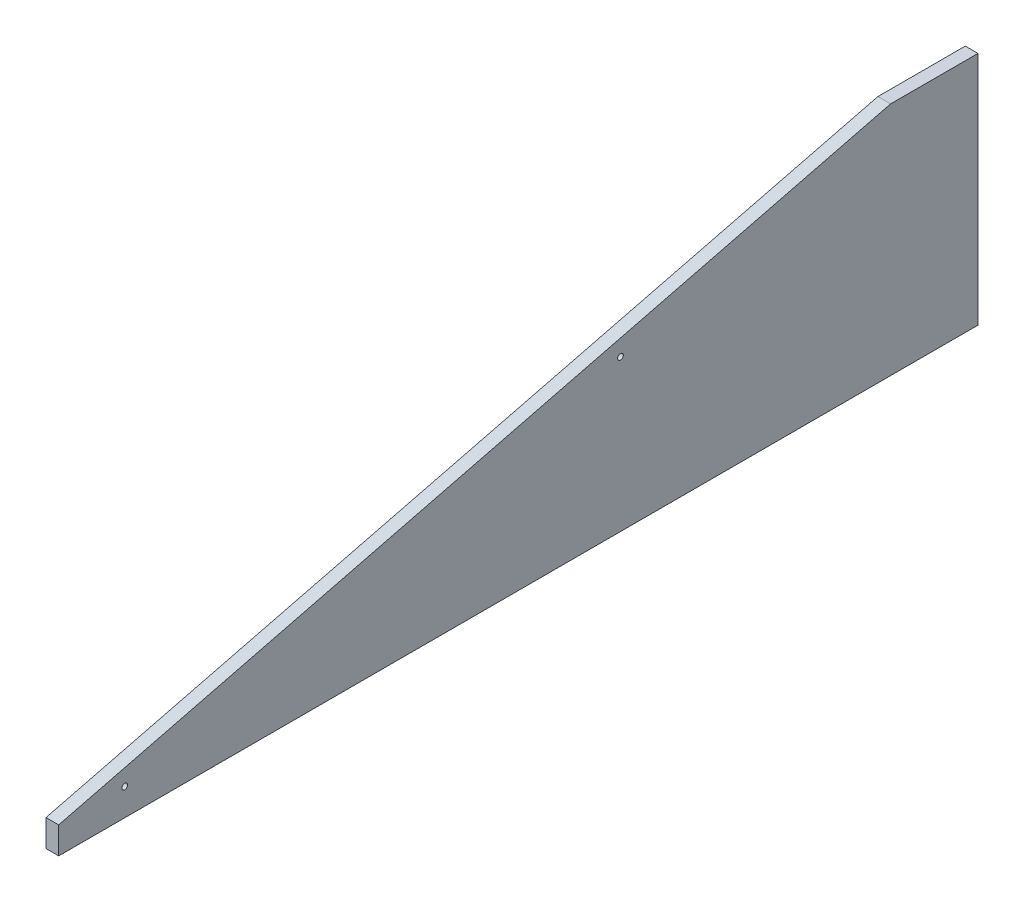
ISO-10303-21;
HEADER;
FILE_DESCRIPTION(('STEP AP214'),'2;1');
FILE_NAME('part.step','',(''),(''),'','','');
FILE_SCHEMA(('AUTOMOTIVE_DESIGN { 1 0 10303 214 1 1 1 1 }'));
ENDSEC;
DATA;
#1=APPLICATION_CONTEXT('core data for automotive mechanical design processes');
#2=APPLICATION_PROTOCOL_DEFINITION('international standard','automotive_design',2000,#1);
#3=PRODUCT_CONTEXT('',#1,'mechanical');
#4=PRODUCT('Part','Part','',(#3));
#5=PRODUCT_RELATED_PRODUCT_CATEGORY('part','',(#4));
#6=PRODUCT_DEFINITION_FORMATION('','',#4);
#7=PRODUCT_DEFINITION_CONTEXT('part definition',#1,'design');
#8=PRODUCT_DEFINITION('design','',#6,#7);
#9=PRODUCT_DEFINITION_SHAPE('','',#8);
#10=(LENGTH_UNIT() NAMED_UNIT(*) SI_UNIT(.MILLI.,.METRE.));
#11=(NAMED_UNIT(*) PLANE_ANGLE_UNIT() SI_UNIT($,.RADIAN.));
#12=(NAMED_UNIT(*) SI_UNIT($,.STERADIAN.) SOLID_ANGLE_UNIT());
#13=UNCERTAINTY_MEASURE_WITH_UNIT(LENGTH_MEASURE(1.E-05),#10,'distance_accuracy_value','');
#14=(GEOMETRIC_REPRESENTATION_CONTEXT(3) GLOBAL_UNCERTAINTY_ASSIGNED_CONTEXT((#13)) GLOBAL_UNIT_ASSIGNED_CONTEXT((#10,
#11,#12)) REPRESENTATION_CONTEXT('',''));
#15=CARTESIAN_POINT('',(0.,0.,0.));
#16=DIRECTION('',(0.,0.,1.));
#17=DIRECTION('',(1.,0.,0.));
#18=AXIS2_PLACEMENT_3D('',#15,#16,#17);
#19=CARTESIAN_POINT('',(149.225,0.,476.25));
#20=DIRECTION('',(0.,-1.,0.));
#21=DIRECTION('',(1.,0.,0.));
#22=AXIS2_PLACEMENT_3D('',#19,#20,#21);
#23=PLANE('',#22);
#24=DIRECTION('',(1.,0.,0.));
#25=VECTOR('',#24,1.);
#26=CARTESIAN_POINT('',(155.225,0.,476.25));
#27=LINE('',#26,#25);
#28=CARTESIAN_POINT('',(149.225,0.,476.25));
#29=VERTEX_POINT('',#28);
#30=CARTESIAN_POINT('',(161.225,0.,476.25));
#31=VERTEX_POINT('',#30);
#32=EDGE_CURVE('E82',#29,#31,#27,.T.);
#33=ORIENTED_EDGE('',*,*,#32,.T.);
#34=DIRECTION('',(0.,0.,-1.));
#35=VECTOR('',#34,1.);
#36=CARTESIAN_POINT('',(161.225,0.,910.3301232825));
#37=LINE('',#36,#35);
#38=CARTESIAN_POINT('',(161.225,0.,1344.410246565));
#39=VERTEX_POINT('',#38);
#40=EDGE_CURVE('E76',#39,#31,#37,.T.);
#41=ORIENTED_EDGE('',*,*,#40,.F.);
#42=DIRECTION('',(-1.,0.,0.));
#43=VECTOR('',#42,1.);
#44=CARTESIAN_POINT('',(155.225,0.,1344.410246565));
#45=LINE('',#44,#43);
#46=CARTESIAN_POINT('',(149.225,0.,1344.410246565));
#47=VERTEX_POINT('',#46);
#48=EDGE_CURVE('E65',#39,#47,#45,.T.);
#49=ORIENTED_EDGE('',*,*,#48,.T.);
#50=DIRECTION('',(0.,0.,-1.));
#51=VECTOR('',#50,1.);
#52=CARTESIAN_POINT('',(149.225,0.,910.3301232825));
#53=LINE('',#52,#51);
#54=EDGE_CURVE('E106',#47,#29,#53,.T.);
#55=ORIENTED_EDGE('',*,*,#54,.T.);
#56=EDGE_LOOP('',(#33,#41,#49,#55));
#57=FACE_BOUND('',#56,.T.);
#58=ADVANCED_FACE('F17',(#57),#23,.T.);
#59=CARTESIAN_POINT('',(149.225,0.,476.25));
#60=DIRECTION('',(0.,0.,1.));
#61=DIRECTION('',(1.,0.,0.));
#62=AXIS2_PLACEMENT_3D('',#59,#60,#61);
#63=PLANE('',#62);
#64=ORIENTED_EDGE('',*,*,#32,.F.);
#65=DIRECTION('',(0.,1.,0.));
#66=VECTOR('',#65,1.);
#67=CARTESIAN_POINT('',(149.225,111.125,476.25));
#68=LINE('',#67,#66);
#69=CARTESIAN_POINT('',(149.225,222.25,476.25));
#70=VERTEX_POINT('',#69);
#71=EDGE_CURVE('E97',#29,#70,#68,.T.);
#72=ORIENTED_EDGE('',*,*,#71,.T.);
#73=DIRECTION('',(1.,0.,0.));
#74=VECTOR('',#73,1.);
#75=CARTESIAN_POINT('',(155.225,222.25,476.25));
#76=LINE('',#75,#74);
#77=CARTESIAN_POINT('',(161.225,222.25,476.25));
#78=VERTEX_POINT('',#77);
#79=EDGE_CURVE('E88',#70,#78,#76,.T.);
#80=ORIENTED_EDGE('',*,*,#79,.T.);
#81=DIRECTION('',(0.,1.,0.));
#82=VECTOR('',#81,1.);
#83=CARTESIAN_POINT('',(161.225,111.125,476.25));
#84=LINE('',#83,#82);
#85=EDGE_CURVE('E56',#31,#78,#84,.T.);
#86=ORIENTED_EDGE('',*,*,#85,.F.);
#87=EDGE_LOOP('',(#64,#72,#80,#86));
#88=FACE_BOUND('',#87,.T.);
#89=ADVANCED_FACE('F114',(#88),#63,.F.);
#90=CARTESIAN_POINT('',(149.225,222.25,476.25));
#91=DIRECTION('',(0.,-1.,0.));
#92=DIRECTION('',(1.,0.,0.));
#93=AXIS2_PLACEMENT_3D('',#90,#91,#92);
#94=PLANE('',#93);
#95=ORIENTED_EDGE('',*,*,#79,.F.);
#96=DIRECTION('',(0.,0.,1.));
#97=VECTOR('',#96,1.);
#98=CARTESIAN_POINT('',(149.225,222.25,910.3301232825));
#99=LINE('',#98,#97);
#100=CARTESIAN_POINT('',(149.225000044457,222.25,558.8));
#101=VERTEX_POINT('',#100);
#102=EDGE_CURVE('E93',#70,#101,#99,.T.);
#103=ORIENTED_EDGE('',*,*,#102,.T.);
#104=DIRECTION('',(1.,0.,0.));
#105=VECTOR('',#104,1.);
#106=CARTESIAN_POINT('',(155.225,222.25,558.8));
#107=LINE('',#106,#105);
#108=CARTESIAN_POINT('',(161.225,222.25,558.799999901015));
#109=VERTEX_POINT('',#108);
#110=EDGE_CURVE('E73',#101,#109,#107,.T.);
#111=ORIENTED_EDGE('',*,*,#110,.T.);
#112=DIRECTION('',(0.,0.,1.));
#113=VECTOR('',#112,1.);
#114=CARTESIAN_POINT('',(161.225,222.25,910.3301232825));
#115=LINE('',#114,#113);
#116=EDGE_CURVE('E49',#78,#109,#115,.T.);
#117=ORIENTED_EDGE('',*,*,#116,.F.);
#118=EDGE_LOOP('',(#95,#103,#111,#117));
#119=FACE_BOUND('',#118,.T.);
#120=ADVANCED_FACE('F121',(#119),#94,.F.);
#121=CARTESIAN_POINT('',(149.225,25.4,1344.410246565));
#122=DIRECTION('',(0.,-0.970012369464204,-0.243055555555601));
#123=DIRECTION('',(0.,0.243055555555601,-0.970012369464204));
#124=AXIS2_PLACEMENT_3D('',#121,#122,#123);
#125=PLANE('',#124);
#126=ORIENTED_EDGE('',*,*,#110,.F.);
#127=DIRECTION('',(0.,0.243055555555601,-0.970012369464204));
#128=VECTOR('',#127,1.);
#129=CARTESIAN_POINT('',(149.225000088915,25.4,1344.410246565));
#130=LINE('',#129,#128);
#131=CARTESIAN_POINT('',(149.225000044457,25.4,1344.410246565));
#132=VERTEX_POINT('',#131);
#133=EDGE_CURVE('E96',#101,#132,#130,.F.);
#134=ORIENTED_EDGE('',*,*,#133,.T.);
#135=DIRECTION('',(1.,0.,0.));
#136=VECTOR('',#135,1.);
#137=CARTESIAN_POINT('',(155.225,25.4,1344.410246565));
#138=LINE('',#137,#136);
#139=CARTESIAN_POINT('',(161.225,25.39999996825,1344.410246565));
#140=VERTEX_POINT('',#139);
#141=EDGE_CURVE('E36',#132,#140,#138,.T.);
#142=ORIENTED_EDGE('',*,*,#141,.T.);
#143=DIRECTION('',(0.,-0.243055555571744,0.970012369460158));
#144=VECTOR('',#143,1.);
#145=CARTESIAN_POINT('',(161.225,222.249999964994,558.799999941737));
#146=LINE('',#145,#144);
#147=EDGE_CURVE('E21',#109,#140,#146,.T.);
#148=ORIENTED_EDGE('',*,*,#147,.F.);
#149=EDGE_LOOP('',(#126,#134,#142,#148));
#150=FACE_BOUND('',#149,.T.);
#151=ADVANCED_FACE('F123',(#150),#125,.F.);
#152=CARTESIAN_POINT('',(161.225,0.,1344.410246565));
#153=DIRECTION('',(0.,0.,-1.));
#154=DIRECTION('',(-1.,0.,0.));
#155=AXIS2_PLACEMENT_3D('',#152,#153,#154);
#156=PLANE('',#155);
#157=ORIENTED_EDGE('',*,*,#141,.F.);
#158=DIRECTION('',(0.,-1.,0.));
#159=VECTOR('',#158,1.);
#160=CARTESIAN_POINT('',(149.225,111.125,1344.410246565));
#161=LINE('',#160,#159);
#162=EDGE_CURVE('E69',#132,#47,#161,.T.);
#163=ORIENTED_EDGE('',*,*,#162,.T.);
#164=ORIENTED_EDGE('',*,*,#48,.F.);
#165=DIRECTION('',(0.,-1.,0.));
#166=VECTOR('',#165,1.);
#167=CARTESIAN_POINT('',(161.225,111.125,1344.410246565));
#168=LINE('',#167,#166);
#169=EDGE_CURVE('E68',#140,#39,#168,.T.);
#170=ORIENTED_EDGE('',*,*,#169,.F.);
#171=EDGE_LOOP('',(#157,#163,#164,#170));
#172=FACE_BOUND('',#171,.T.);
#173=ADVANCED_FACE('F67',(#172),#156,.F.);
#174=CARTESIAN_POINT('',(161.225,25.591866853,1281.987837884));
#175=DIRECTION('',(-1.,0.,0.));
#176=DIRECTION('',(0.,0.,1.));
#177=AXIS2_PLACEMENT_3D('',#174,#175,#176);
#178=CYLINDRICAL_SURFACE('',#177,2.667);
#179=CARTESIAN_POINT('',(149.225,25.591866853,1281.987837884));
#180=DIRECTION('',(-1.,0.,0.));
#181=DIRECTION('',(0.,0.,1.));
#182=AXIS2_PLACEMENT_3D('',#179,#180,#181);
#183=CIRCLE('',#182,2.667);
#184=CARTESIAN_POINT('',(149.225,25.591866853,1284.654837884));
#185=VERTEX_POINT('',#184);
#186=EDGE_CURVE('E98',#185,#185,#183,.T.);
#187=ORIENTED_EDGE('',*,*,#186,.T.);
#188=EDGE_LOOP('',(#187));
#189=FACE_BOUND('',#188,.T.);
#190=CARTESIAN_POINT('',(161.225,25.591866853,1281.987837884));
#191=DIRECTION('',(-1.,0.,0.));
#192=DIRECTION('',(0.,0.,1.));
#193=AXIS2_PLACEMENT_3D('',#190,#191,#192);
#194=CIRCLE('',#193,2.667);
#195=CARTESIAN_POINT('',(161.225,25.591866853,1284.654837884));
#196=VERTEX_POINT('',#195);
#197=EDGE_CURVE('E79',#196,#196,#194,.T.);
#198=ORIENTED_EDGE('',*,*,#197,.F.);
#199=EDGE_LOOP('',(#198));
#200=FACE_BOUND('',#199,.T.);
#201=ADVANCED_FACE('F131',(#189,#200),#178,.F.);
#202=CARTESIAN_POINT('',(161.225,0.,476.25));
#203=DIRECTION('',(1.,0.,0.));
#204=DIRECTION('',(0.,1.,0.));
#205=AXIS2_PLACEMENT_3D('',#202,#203,#204);
#206=PLANE('',#205);
#207=ORIENTED_EDGE('',*,*,#197,.T.);
#208=EDGE_LOOP('',(#207));
#209=FACE_BOUND('',#208,.T.);
#210=CARTESIAN_POINT('',(161.225,142.890477965,813.859868381));
#211=DIRECTION('',(-1.,0.,0.));
#212=DIRECTION('',(0.,0.,1.));
#213=AXIS2_PLACEMENT_3D('',#210,#211,#212);
#214=CIRCLE('',#213,2.66700000000003);
#215=CARTESIAN_POINT('',(161.225,142.890477965,816.526868381));
#216=VERTEX_POINT('',#215);
#217=EDGE_CURVE('E27',#216,#216,#214,.F.);
#218=ORIENTED_EDGE('',*,*,#217,.F.);
#219=EDGE_LOOP('',(#218));
#220=FACE_BOUND('',#219,.T.);
#221=ORIENTED_EDGE('',*,*,#147,.T.);
#222=ORIENTED_EDGE('',*,*,#169,.T.);
#223=ORIENTED_EDGE('',*,*,#40,.T.);
#224=ORIENTED_EDGE('',*,*,#85,.T.);
#225=ORIENTED_EDGE('',*,*,#116,.T.);
#226=EDGE_LOOP('',(#221,#222,#223,#224,#225));
#227=FACE_BOUND('',#226,.T.);
#228=ADVANCED_FACE('F75',(#209,#220,#227),#206,.T.);
#229=CARTESIAN_POINT('',(149.225,0.,476.25));
#230=DIRECTION('',(1.,0.,0.));
#231=DIRECTION('',(0.,1.,0.));
#232=AXIS2_PLACEMENT_3D('',#229,#230,#231);
#233=PLANE('',#232);
#234=ORIENTED_EDGE('',*,*,#186,.F.);
#235=EDGE_LOOP('',(#234));
#236=FACE_BOUND('',#235,.T.);
#237=CARTESIAN_POINT('',(149.225,142.890477965,813.859868381));
#238=DIRECTION('',(-1.,0.,0.));
#239=DIRECTION('',(0.,0.,1.));
#240=AXIS2_PLACEMENT_3D('',#237,#238,#239);
#241=CIRCLE('',#240,2.66700000000003);
#242=CARTESIAN_POINT('',(149.225,142.890477965,816.526868381));
#243=VERTEX_POINT('',#242);
#244=EDGE_CURVE('E11',#243,#243,#241,.T.);
#245=ORIENTED_EDGE('',*,*,#244,.F.);
#246=EDGE_LOOP('',(#245));
#247=FACE_BOUND('',#246,.T.);
#248=ORIENTED_EDGE('',*,*,#133,.F.);
#249=ORIENTED_EDGE('',*,*,#102,.F.);
#250=ORIENTED_EDGE('',*,*,#71,.F.);
#251=ORIENTED_EDGE('',*,*,#54,.F.);
#252=ORIENTED_EDGE('',*,*,#162,.F.);
#253=EDGE_LOOP('',(#248,#249,#250,#251,#252));
#254=FACE_BOUND('',#253,.T.);
#255=ADVANCED_FACE('F19',(#236,#247,#254),#233,.F.);
#256=CARTESIAN_POINT('',(161.225,142.890477965,813.859868381));
#257=DIRECTION('',(-1.,0.,0.));
#258=DIRECTION('',(0.,0.,1.));
#259=AXIS2_PLACEMENT_3D('',#256,#257,#258);
#260=CYLINDRICAL_SURFACE('',#259,2.66700000000003);
#261=ORIENTED_EDGE('',*,*,#244,.T.);
#262=EDGE_LOOP('',(#261));
#263=FACE_BOUND('',#262,.T.);
#264=ORIENTED_EDGE('',*,*,#217,.T.);
#265=EDGE_LOOP('',(#264));
#266=FACE_BOUND('',#265,.T.);
#267=ADVANCED_FACE('F134',(#263,#266),#260,.F.);
#268=CLOSED_SHELL('',(#58,#89,#120,#151,#173,#201,#228,#255,#267));
#269=MANIFOLD_SOLID_BREP('B1',#268);
#270=ADVANCED_BREP_SHAPE_REPRESENTATION('',(#18,#269),#14);
#271=SHAPE_DEFINITION_REPRESENTATION(#9,#270);
ENDSEC;
END-ISO-10303-21;
